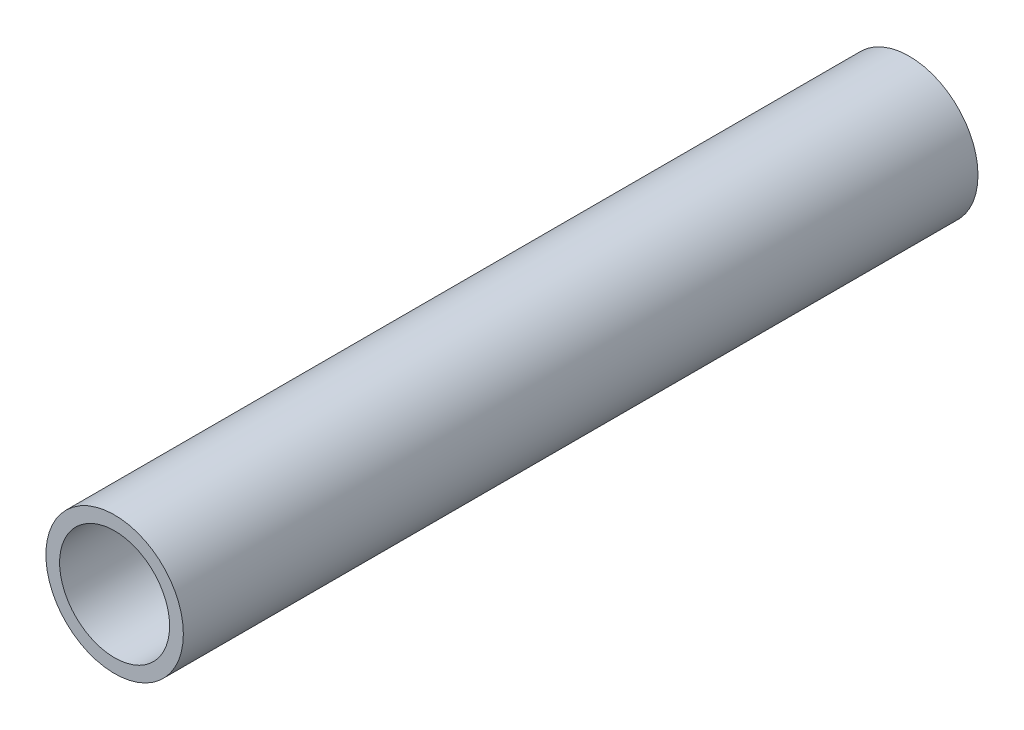
ISO-10303-21;
HEADER;
FILE_DESCRIPTION(('STEP AP214'),'2;1');
FILE_NAME('part.step','',(''),(''),'','','');
FILE_SCHEMA(('AUTOMOTIVE_DESIGN { 1 0 10303 214 1 1 1 1 }'));
ENDSEC;
DATA;
#1=APPLICATION_CONTEXT('core data for automotive mechanical design processes');
#2=APPLICATION_PROTOCOL_DEFINITION('international standard','automotive_design',2000,#1);
#3=PRODUCT_CONTEXT('',#1,'mechanical');
#4=PRODUCT('Part','Part','',(#3));
#5=PRODUCT_RELATED_PRODUCT_CATEGORY('part','',(#4));
#6=PRODUCT_DEFINITION_FORMATION('','',#4);
#7=PRODUCT_DEFINITION_CONTEXT('part definition',#1,'design');
#8=PRODUCT_DEFINITION('design','',#6,#7);
#9=PRODUCT_DEFINITION_SHAPE('','',#8);
#10=(LENGTH_UNIT() NAMED_UNIT(*) SI_UNIT(.MILLI.,.METRE.));
#11=(NAMED_UNIT(*) PLANE_ANGLE_UNIT() SI_UNIT($,.RADIAN.));
#12=(NAMED_UNIT(*) SI_UNIT($,.STERADIAN.) SOLID_ANGLE_UNIT());
#13=UNCERTAINTY_MEASURE_WITH_UNIT(LENGTH_MEASURE(1.E-05),#10,'distance_accuracy_value','');
#14=(GEOMETRIC_REPRESENTATION_CONTEXT(3) GLOBAL_UNCERTAINTY_ASSIGNED_CONTEXT((#13)) GLOBAL_UNIT_ASSIGNED_CONTEXT((#10,
#11,#12)) REPRESENTATION_CONTEXT('',''));
#15=CARTESIAN_POINT('',(0.,0.,0.));
#16=DIRECTION('',(0.,0.,1.));
#17=DIRECTION('',(1.,0.,0.));
#18=AXIS2_PLACEMENT_3D('',#15,#16,#17);
#19=CARTESIAN_POINT('',(0.,0.,14.45));
#20=DIRECTION('',(0.,0.,1.));
#21=DIRECTION('',(1.,0.,0.));
#22=AXIS2_PLACEMENT_3D('',#19,#20,#21);
#23=PLANE('',#22);
#24=CARTESIAN_POINT('',(0.,0.,14.45));
#25=DIRECTION('',(0.,0.,1.));
#26=DIRECTION('',(1.,0.,0.));
#27=AXIS2_PLACEMENT_3D('',#24,#25,#26);
#28=CIRCLE('',#27,1.25);
#29=CARTESIAN_POINT('',(1.25,0.,14.45));
#30=VERTEX_POINT('',#29);
#31=EDGE_CURVE('E10',#30,#30,#28,.T.);
#32=ORIENTED_EDGE('',*,*,#31,.T.);
#33=EDGE_LOOP('',(#32));
#34=FACE_BOUND('',#33,.T.);
#35=CARTESIAN_POINT('',(0.,0.,14.45));
#36=DIRECTION('',(0.,0.,1.));
#37=DIRECTION('',(1.,0.,0.));
#38=AXIS2_PLACEMENT_3D('',#35,#36,#37);
#39=CIRCLE('',#38,1.);
#40=CARTESIAN_POINT('',(1.,0.,14.45));
#41=VERTEX_POINT('',#40);
#42=EDGE_CURVE('E41',#41,#41,#39,.T.);
#43=ORIENTED_EDGE('',*,*,#42,.F.);
#44=EDGE_LOOP('',(#43));
#45=FACE_BOUND('',#44,.T.);
#46=ADVANCED_FACE('F30',(#34,#45),#23,.T.);
#47=CARTESIAN_POINT('',(0.,0.,0.));
#48=DIRECTION('',(0.,0.,1.));
#49=DIRECTION('',(1.,0.,0.));
#50=AXIS2_PLACEMENT_3D('',#47,#48,#49);
#51=PLANE('',#50);
#52=CARTESIAN_POINT('',(0.,0.,0.));
#53=DIRECTION('',(0.,0.,1.));
#54=DIRECTION('',(1.,0.,0.));
#55=AXIS2_PLACEMENT_3D('',#52,#53,#54);
#56=CIRCLE('',#55,1.25);
#57=CARTESIAN_POINT('',(1.25,0.,0.));
#58=VERTEX_POINT('',#57);
#59=EDGE_CURVE('E34',#58,#58,#56,.T.);
#60=ORIENTED_EDGE('',*,*,#59,.F.);
#61=EDGE_LOOP('',(#60));
#62=FACE_BOUND('',#61,.T.);
#63=CARTESIAN_POINT('',(0.,0.,0.));
#64=DIRECTION('',(0.,0.,1.));
#65=DIRECTION('',(1.,0.,0.));
#66=AXIS2_PLACEMENT_3D('',#63,#64,#65);
#67=CIRCLE('',#66,1.);
#68=CARTESIAN_POINT('',(1.,0.,0.));
#69=VERTEX_POINT('',#68);
#70=EDGE_CURVE('E43',#69,#69,#67,.T.);
#71=ORIENTED_EDGE('',*,*,#70,.T.);
#72=EDGE_LOOP('',(#71));
#73=FACE_BOUND('',#72,.T.);
#74=ADVANCED_FACE('F53',(#62,#73),#51,.F.);
#75=CARTESIAN_POINT('',(0.,0.,14.45));
#76=DIRECTION('',(0.,0.,-1.));
#77=DIRECTION('',(-1.,0.,0.));
#78=AXIS2_PLACEMENT_3D('',#75,#76,#77);
#79=CYLINDRICAL_SURFACE('',#78,1.25);
#80=ORIENTED_EDGE('',*,*,#31,.F.);
#81=EDGE_LOOP('',(#80));
#82=FACE_BOUND('',#81,.T.);
#83=ORIENTED_EDGE('',*,*,#59,.T.);
#84=EDGE_LOOP('',(#83));
#85=FACE_BOUND('',#84,.T.);
#86=ADVANCED_FACE('F32',(#82,#85),#79,.T.);
#87=CARTESIAN_POINT('',(0.,0.,14.45));
#88=DIRECTION('',(0.,0.,-1.));
#89=DIRECTION('',(-1.,0.,0.));
#90=AXIS2_PLACEMENT_3D('',#87,#88,#89);
#91=CYLINDRICAL_SURFACE('',#90,1.);
#92=ORIENTED_EDGE('',*,*,#42,.T.);
#93=EDGE_LOOP('',(#92));
#94=FACE_BOUND('',#93,.T.);
#95=ORIENTED_EDGE('',*,*,#70,.F.);
#96=EDGE_LOOP('',(#95));
#97=FACE_BOUND('',#96,.T.);
#98=ADVANCED_FACE('F49',(#94,#97),#91,.F.);
#99=CLOSED_SHELL('',(#46,#74,#86,#98));
#100=MANIFOLD_SOLID_BREP('B2',#99);
#101=ADVANCED_BREP_SHAPE_REPRESENTATION('',(#18,#100),#14);
#102=SHAPE_DEFINITION_REPRESENTATION(#9,#101);
ENDSEC;
END-ISO-10303-21;
